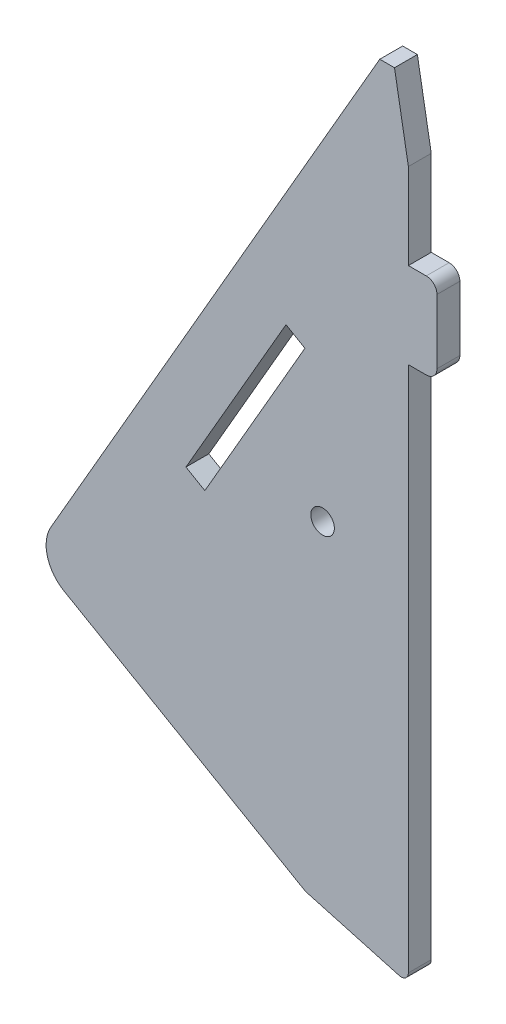
ISO-10303-21;
HEADER;
FILE_DESCRIPTION(('STEP AP214'),'2;1');
FILE_NAME('part.step','',(''),(''),'','','');
FILE_SCHEMA(('AUTOMOTIVE_DESIGN { 1 0 10303 214 1 1 1 1 }'));
ENDSEC;
DATA;
#1=APPLICATION_CONTEXT('core data for automotive mechanical design processes');
#2=APPLICATION_PROTOCOL_DEFINITION('international standard','automotive_design',2000,#1);
#3=PRODUCT_CONTEXT('',#1,'mechanical');
#4=PRODUCT('Part','Part','',(#3));
#5=PRODUCT_RELATED_PRODUCT_CATEGORY('part','',(#4));
#6=PRODUCT_DEFINITION_FORMATION('','',#4);
#7=PRODUCT_DEFINITION_CONTEXT('part definition',#1,'design');
#8=PRODUCT_DEFINITION('design','',#6,#7);
#9=PRODUCT_DEFINITION_SHAPE('','',#8);
#10=(LENGTH_UNIT() NAMED_UNIT(*) SI_UNIT(.MILLI.,.METRE.));
#11=(NAMED_UNIT(*) PLANE_ANGLE_UNIT() SI_UNIT($,.RADIAN.));
#12=(NAMED_UNIT(*) SI_UNIT($,.STERADIAN.) SOLID_ANGLE_UNIT());
#13=UNCERTAINTY_MEASURE_WITH_UNIT(LENGTH_MEASURE(1.E-05),#10,'distance_accuracy_value','');
#14=(GEOMETRIC_REPRESENTATION_CONTEXT(3) GLOBAL_UNCERTAINTY_ASSIGNED_CONTEXT((#13)) GLOBAL_UNIT_ASSIGNED_CONTEXT((#10,
#11,#12)) REPRESENTATION_CONTEXT('',''));
#15=CARTESIAN_POINT('',(0.,0.,0.));
#16=DIRECTION('',(0.,0.,1.));
#17=DIRECTION('',(1.,0.,0.));
#18=AXIS2_PLACEMENT_3D('',#15,#16,#17);
#19=CARTESIAN_POINT('',(49.9999999999627,44.0000000000083,3.2));
#20=DIRECTION('',(-1.,0.,0.));
#21=DIRECTION('',(0.,0.,1.));
#22=AXIS2_PLACEMENT_3D('',#19,#20,#21);
#23=PLANE('',#22);
#24=DIRECTION('',(0.,1.,0.));
#25=VECTOR('',#24,1.);
#26=CARTESIAN_POINT('',(49.9999999999627,44.0000000000083,3.2));
#27=LINE('',#26,#25);
#28=CARTESIAN_POINT('',(49.9999999999627,32.0000000000083,3.2));
#29=VERTEX_POINT('',#28);
#30=CARTESIAN_POINT('',(49.9999999999627,44.0000000000083,3.2));
#31=VERTEX_POINT('',#30);
#32=EDGE_CURVE('E210',#29,#31,#27,.T.);
#33=ORIENTED_EDGE('',*,*,#32,.F.);
#34=DIRECTION('',(0.,0.,1.));
#35=VECTOR('',#34,1.);
#36=CARTESIAN_POINT('',(49.9999999999627,32.0000000000083,-12.6491106406735));
#37=LINE('',#36,#35);
#38=CARTESIAN_POINT('',(49.9999999999627,32.0000000000083,0.));
#39=VERTEX_POINT('',#38);
#40=EDGE_CURVE('E209',#39,#29,#37,.T.);
#41=ORIENTED_EDGE('',*,*,#40,.F.);
#42=DIRECTION('',(0.,1.,0.));
#43=VECTOR('',#42,1.);
#44=CARTESIAN_POINT('',(49.9999999999627,44.0000000000083,0.));
#45=LINE('',#44,#43);
#46=CARTESIAN_POINT('',(49.9999999999627,44.0000000000083,0.));
#47=VERTEX_POINT('',#46);
#48=EDGE_CURVE('E192',#39,#47,#45,.T.);
#49=ORIENTED_EDGE('',*,*,#48,.T.);
#50=DIRECTION('',(0.,0.,-1.));
#51=VECTOR('',#50,1.);
#52=CARTESIAN_POINT('',(49.9999999999627,44.0000000000083,3.2));
#53=LINE('',#52,#51);
#54=EDGE_CURVE('E350',#31,#47,#53,.T.);
#55=ORIENTED_EDGE('',*,*,#54,.F.);
#56=EDGE_LOOP('',(#33,#41,#49,#55));
#57=FACE_BOUND('',#56,.T.);
#58=ADVANCED_FACE('F38',(#57),#23,.F.);
#59=CARTESIAN_POINT('',(48.9999999999626,-53.6846267095835,3.2));
#60=DIRECTION('',(0.,0.,1.));
#61=DIRECTION('',(1.,0.,0.));
#62=AXIS2_PLACEMENT_3D('',#59,#60,#61);
#63=PLANE('',#62);
#64=CARTESIAN_POINT('',(38.,-5.,3.2));
#65=DIRECTION('',(0.,0.,1.));
#66=DIRECTION('',(1.,0.,0.));
#67=AXIS2_PLACEMENT_3D('',#64,#65,#66);
#68=CIRCLE('',#67,1.65);
#69=CARTESIAN_POINT('',(39.65,-5.,3.2));
#70=VERTEX_POINT('',#69);
#71=EDGE_CURVE('E282',#70,#70,#68,.T.);
#72=ORIENTED_EDGE('',*,*,#71,.F.);
#73=EDGE_LOOP('',(#72));
#74=FACE_BOUND('',#73,.T.);
#75=DIRECTION('',(0.,1.,0.));
#76=VECTOR('',#75,1.);
#77=CARTESIAN_POINT('',(53.9999999999626,32.0000000000083,3.2));
#78=LINE('',#77,#76);
#79=CARTESIAN_POINT('',(53.9999999999626,21.5000000000083,3.2));
#80=VERTEX_POINT('',#79);
#81=CARTESIAN_POINT('',(53.9999999999626,30.5000000000083,3.2));
#82=VERTEX_POINT('',#81);
#83=EDGE_CURVE('E230',#80,#82,#78,.T.);
#84=ORIENTED_EDGE('',*,*,#83,.T.);
#85=CARTESIAN_POINT('',(52.4999999999626,30.5000000000083,3.2));
#86=DIRECTION('',(0.,0.,1.));
#87=DIRECTION('',(1.,0.,0.));
#88=AXIS2_PLACEMENT_3D('',#85,#86,#87);
#89=CIRCLE('',#88,1.5);
#90=CARTESIAN_POINT('',(52.4999999999626,32.0000000000083,3.2));
#91=VERTEX_POINT('',#90);
#92=EDGE_CURVE('E369',#82,#91,#89,.T.);
#93=ORIENTED_EDGE('',*,*,#92,.T.);
#94=DIRECTION('',(-1.,0.,0.));
#95=VECTOR('',#94,1.);
#96=CARTESIAN_POINT('',(49.9999999999627,32.0000000000083,3.2));
#97=LINE('',#96,#95);
#98=EDGE_CURVE('E234',#91,#29,#97,.T.);
#99=ORIENTED_EDGE('',*,*,#98,.T.);
#100=ORIENTED_EDGE('',*,*,#32,.T.);
#101=DIRECTION('',(-0.173648177667528,0.984807753012103,0.));
#102=VECTOR('',#101,1.);
#103=CARTESIAN_POINT('',(49.9999999999627,44.0000000000083,3.2));
#104=LINE('',#103,#102);
#105=CARTESIAN_POINT('',(48.0604032121626,55.0000000000083,3.2));
#106=VERTEX_POINT('',#105);
#107=EDGE_CURVE('E301',#31,#106,#104,.T.);
#108=ORIENTED_EDGE('',*,*,#107,.T.);
#109=DIRECTION('',(-1.,0.,0.));
#110=VECTOR('',#109,1.);
#111=CARTESIAN_POINT('',(45.9999999999626,55.0000000000083,3.2));
#112=LINE('',#111,#110);
#113=CARTESIAN_POINT('',(45.9999999999626,55.0000000000083,3.2));
#114=VERTEX_POINT('',#113);
#115=EDGE_CURVE('E303',#106,#114,#112,.T.);
#116=ORIENTED_EDGE('',*,*,#115,.T.);
#117=DIRECTION('',(-0.5,-0.866025403784439,0.));
#118=VECTOR('',#117,1.);
#119=CARTESIAN_POINT('',(-4.52970386238235E-11,-24.6743371481738,3.2));
#120=LINE('',#119,#118);
#121=CARTESIAN_POINT('',(-4.52953646812304E-11,-24.6743371481738,3.2));
#122=VERTEX_POINT('',#121);
#123=EDGE_CURVE('E305',#114,#122,#120,.T.);
#124=ORIENTED_EDGE('',*,*,#123,.T.);
#125=CARTESIAN_POINT('',(4.33012701887688,-27.1743371481738,3.2));
#126=DIRECTION('',(0.,0.,1.));
#127=DIRECTION('',(1.,0.,0.));
#128=AXIS2_PLACEMENT_3D('',#125,#126,#127);
#129=CIRCLE('',#128,4.99999999999998);
#130=CARTESIAN_POINT('',(1.83012701886026,-31.5044641670864,3.2));
#131=VERTEX_POINT('',#130);
#132=EDGE_CURVE('E308',#122,#131,#129,.T.);
#133=ORIENTED_EDGE('',*,*,#132,.T.);
#134=DIRECTION('',(0.866025403784439,-0.5,0.));
#135=VECTOR('',#134,1.);
#136=CARTESIAN_POINT('',(1.83012701886026,-31.5044641670864,3.2));
#137=LINE('',#136,#135);
#138=CARTESIAN_POINT('',(35.6051177664489,-51.0044641670838,3.2));
#139=VERTEX_POINT('',#138);
#140=EDGE_CURVE('E311',#131,#139,#137,.T.);
#141=ORIENTED_EDGE('',*,*,#140,.T.);
#142=DIRECTION('',(0.963570411999862,-0.267454783315641,0.));
#143=VECTOR('',#142,1.);
#144=CARTESIAN_POINT('',(35.6051177664489,-51.0044641670838,3.2));
#145=LINE('',#144,#143);
#146=CARTESIAN_POINT('',(48.7325452166489,-54.6481971215838,3.2));
#147=VERTEX_POINT('',#146);
#148=EDGE_CURVE('E290',#139,#147,#145,.T.);
#149=ORIENTED_EDGE('',*,*,#148,.T.);
#150=CARTESIAN_POINT('',(48.9999999999626,-53.6846267095835,3.2));
#151=DIRECTION('',(0.,0.,1.));
#152=DIRECTION('',(1.,0.,0.));
#153=AXIS2_PLACEMENT_3D('',#150,#151,#152);
#154=CIRCLE('',#153,0.999999999999998);
#155=CARTESIAN_POINT('',(49.9999999999627,-53.6846267095839,3.2));
#156=VERTEX_POINT('',#155);
#157=EDGE_CURVE('E294',#147,#156,#154,.T.);
#158=ORIENTED_EDGE('',*,*,#157,.T.);
#159=CARTESIAN_POINT('',(49.9999999999627,20.0000000000083,3.2));
#160=VERTEX_POINT('',#159);
#161=EDGE_CURVE('E297',#156,#160,#27,.T.);
#162=ORIENTED_EDGE('',*,*,#161,.T.);
#163=DIRECTION('',(1.,0.,0.));
#164=VECTOR('',#163,1.);
#165=CARTESIAN_POINT('',(49.9999999999627,20.0000000000083,3.2));
#166=LINE('',#165,#164);
#167=CARTESIAN_POINT('',(52.4999999999626,20.0000000000083,3.2));
#168=VERTEX_POINT('',#167);
#169=EDGE_CURVE('E226',#160,#168,#166,.T.);
#170=ORIENTED_EDGE('',*,*,#169,.T.);
#171=CARTESIAN_POINT('',(52.4999999999626,21.5000000000083,3.2));
#172=DIRECTION('',(0.,0.,1.));
#173=DIRECTION('',(1.,0.,0.));
#174=AXIS2_PLACEMENT_3D('',#171,#172,#173);
#175=CIRCLE('',#174,1.5);
#176=EDGE_CURVE('E366',#168,#80,#175,.T.);
#177=ORIENTED_EDGE('',*,*,#176,.T.);
#178=EDGE_LOOP('',(#84,#93,#99,#100,#108,#116,#124,#133,#141,#149,#158,#162,#170,#177));
#179=FACE_BOUND('',#178,.T.);
#180=DIRECTION('',(0.5,0.866025403784439,0.));
#181=VECTOR('',#180,1.);
#182=CARTESIAN_POINT('',(21.5341797856962,-9.49604366002328,3.2));
#183=LINE('',#182,#181);
#184=CARTESIAN_POINT('',(21.5341797856962,-9.49604366002328,3.2));
#185=VERTEX_POINT('',#184);
#186=CARTESIAN_POINT('',(35.5341797856684,14.7526676458928,3.2));
#187=VERTEX_POINT('',#186);
#188=EDGE_CURVE('E242',#185,#187,#183,.T.);
#189=ORIENTED_EDGE('',*,*,#188,.F.);
#190=DIRECTION('',(0.866025403784439,-0.5,0.));
#191=VECTOR('',#190,1.);
#192=CARTESIAN_POINT('',(18.8841420501011,-7.96604366001479,3.2));
#193=LINE('',#192,#191);
#194=CARTESIAN_POINT('',(18.8841420501011,-7.96604366001479,3.2));
#195=VERTEX_POINT('',#194);
#196=EDGE_CURVE('E239',#195,#185,#193,.T.);
#197=ORIENTED_EDGE('',*,*,#196,.F.);
#198=DIRECTION('',(-0.5,-0.866025403784438,0.));
#199=VECTOR('',#198,1.);
#200=CARTESIAN_POINT('',(18.8841420501011,-7.96604366001479,3.2));
#201=LINE('',#200,#199);
#202=CARTESIAN_POINT('',(32.8841420500733,16.2826676459013,3.2));
#203=VERTEX_POINT('',#202);
#204=EDGE_CURVE('E250',#203,#195,#201,.T.);
#205=ORIENTED_EDGE('',*,*,#204,.F.);
#206=DIRECTION('',(-0.866025403784439,0.499999999999999,0.));
#207=VECTOR('',#206,1.);
#208=CARTESIAN_POINT('',(35.5341797856684,14.7526676458928,3.2));
#209=LINE('',#208,#207);
#210=EDGE_CURVE('E246',#187,#203,#209,.T.);
#211=ORIENTED_EDGE('',*,*,#210,.F.);
#212=EDGE_LOOP('',(#189,#197,#205,#211));
#213=FACE_BOUND('',#212,.T.);
#214=ADVANCED_FACE('F385',(#74,#179,#213),#63,.T.);
#215=CARTESIAN_POINT('',(48.9999999999626,-53.6846267095835,0.));
#216=DIRECTION('',(0.,0.,1.));
#217=DIRECTION('',(1.,0.,0.));
#218=AXIS2_PLACEMENT_3D('',#215,#216,#217);
#219=PLANE('',#218);
#220=CARTESIAN_POINT('',(38.,-5.,0.));
#221=DIRECTION('',(0.,0.,1.));
#222=DIRECTION('',(1.,0.,0.));
#223=AXIS2_PLACEMENT_3D('',#220,#221,#222);
#224=CIRCLE('',#223,1.65);
#225=CARTESIAN_POINT('',(39.65,-5.,0.));
#226=VERTEX_POINT('',#225);
#227=EDGE_CURVE('E281',#226,#226,#224,.T.);
#228=ORIENTED_EDGE('',*,*,#227,.T.);
#229=EDGE_LOOP('',(#228));
#230=FACE_BOUND('',#229,.T.);
#231=DIRECTION('',(1.,0.,0.));
#232=VECTOR('',#231,1.);
#233=CARTESIAN_POINT('',(49.9999999999627,32.0000000000083,0.));
#234=LINE('',#233,#232);
#235=CARTESIAN_POINT('',(52.4999999999626,32.0000000000083,0.));
#236=VERTEX_POINT('',#235);
#237=EDGE_CURVE('E196',#39,#236,#234,.T.);
#238=ORIENTED_EDGE('',*,*,#237,.T.);
#239=CARTESIAN_POINT('',(52.4999999999626,30.5000000000083,0.));
#240=DIRECTION('',(0.,0.,1.));
#241=DIRECTION('',(1.,0.,0.));
#242=AXIS2_PLACEMENT_3D('',#239,#240,#241);
#243=CIRCLE('',#242,1.5);
#244=CARTESIAN_POINT('',(53.9999999999626,30.5000000000083,0.));
#245=VERTEX_POINT('',#244);
#246=EDGE_CURVE('E47',#236,#245,#243,.F.);
#247=ORIENTED_EDGE('',*,*,#246,.T.);
#248=DIRECTION('',(0.,-1.,0.));
#249=VECTOR('',#248,1.);
#250=CARTESIAN_POINT('',(53.9999999999626,32.0000000000083,0.));
#251=LINE('',#250,#249);
#252=CARTESIAN_POINT('',(53.9999999999626,21.5000000000083,0.));
#253=VERTEX_POINT('',#252);
#254=EDGE_CURVE('E212',#245,#253,#251,.T.);
#255=ORIENTED_EDGE('',*,*,#254,.T.);
#256=CARTESIAN_POINT('',(52.4999999999626,21.5000000000083,0.));
#257=DIRECTION('',(0.,0.,1.));
#258=DIRECTION('',(1.,0.,0.));
#259=AXIS2_PLACEMENT_3D('',#256,#257,#258);
#260=CIRCLE('',#259,1.5);
#261=CARTESIAN_POINT('',(52.4999999999626,20.0000000000083,0.));
#262=VERTEX_POINT('',#261);
#263=EDGE_CURVE('E57',#253,#262,#260,.F.);
#264=ORIENTED_EDGE('',*,*,#263,.T.);
#265=DIRECTION('',(-1.,0.,0.));
#266=VECTOR('',#265,1.);
#267=CARTESIAN_POINT('',(49.9999999999627,20.0000000000083,0.));
#268=LINE('',#267,#266);
#269=CARTESIAN_POINT('',(49.9999999999627,20.0000000000083,0.));
#270=VERTEX_POINT('',#269);
#271=EDGE_CURVE('E217',#262,#270,#268,.T.);
#272=ORIENTED_EDGE('',*,*,#271,.T.);
#273=CARTESIAN_POINT('',(49.9999999999627,-53.6846267095839,0.));
#274=VERTEX_POINT('',#273);
#275=EDGE_CURVE('E204',#274,#270,#45,.T.);
#276=ORIENTED_EDGE('',*,*,#275,.F.);
#277=CARTESIAN_POINT('',(48.9999999999626,-53.6846267095835,0.));
#278=DIRECTION('',(0.,0.,1.));
#279=DIRECTION('',(1.,0.,0.));
#280=AXIS2_PLACEMENT_3D('',#277,#278,#279);
#281=CIRCLE('',#280,0.999999999999998);
#282=CARTESIAN_POINT('',(48.7325452166489,-54.6481971215838,0.));
#283=VERTEX_POINT('',#282);
#284=EDGE_CURVE('E205',#283,#274,#281,.T.);
#285=ORIENTED_EDGE('',*,*,#284,.F.);
#286=DIRECTION('',(0.963570411999862,-0.267454783315641,0.));
#287=VECTOR('',#286,1.);
#288=CARTESIAN_POINT('',(35.6051177664489,-51.0044641670838,0.));
#289=LINE('',#288,#287);
#290=CARTESIAN_POINT('',(35.6051177664489,-51.0044641670838,0.));
#291=VERTEX_POINT('',#290);
#292=EDGE_CURVE('E286',#291,#283,#289,.T.);
#293=ORIENTED_EDGE('',*,*,#292,.F.);
#294=DIRECTION('',(0.866025403784439,-0.5,0.));
#295=VECTOR('',#294,1.);
#296=CARTESIAN_POINT('',(1.83012701886026,-31.5044641670864,0.));
#297=LINE('',#296,#295);
#298=CARTESIAN_POINT('',(1.83012701886026,-31.5044641670864,0.));
#299=VERTEX_POINT('',#298);
#300=EDGE_CURVE('E295',#299,#291,#297,.T.);
#301=ORIENTED_EDGE('',*,*,#300,.F.);
#302=CARTESIAN_POINT('',(4.33012701887688,-27.1743371481738,0.));
#303=DIRECTION('',(0.,0.,1.));
#304=DIRECTION('',(1.,0.,0.));
#305=AXIS2_PLACEMENT_3D('',#302,#303,#304);
#306=CIRCLE('',#305,4.99999999999998);
#307=CARTESIAN_POINT('',(-4.52953646812304E-11,-24.6743371481738,0.));
#308=VERTEX_POINT('',#307);
#309=EDGE_CURVE('E328',#308,#299,#306,.T.);
#310=ORIENTED_EDGE('',*,*,#309,.F.);
#311=DIRECTION('',(-0.5,-0.866025403784439,0.));
#312=VECTOR('',#311,1.);
#313=CARTESIAN_POINT('',(-4.52970386238235E-11,-24.6743371481738,0.));
#314=LINE('',#313,#312);
#315=CARTESIAN_POINT('',(45.9999999999626,55.0000000000083,0.));
#316=VERTEX_POINT('',#315);
#317=EDGE_CURVE('E325',#316,#308,#314,.T.);
#318=ORIENTED_EDGE('',*,*,#317,.F.);
#319=DIRECTION('',(-1.,0.,0.));
#320=VECTOR('',#319,1.);
#321=CARTESIAN_POINT('',(45.9999999999626,55.0000000000083,0.));
#322=LINE('',#321,#320);
#323=CARTESIAN_POINT('',(48.0604032121626,55.0000000000083,0.));
#324=VERTEX_POINT('',#323);
#325=EDGE_CURVE('E323',#324,#316,#322,.T.);
#326=ORIENTED_EDGE('',*,*,#325,.F.);
#327=DIRECTION('',(-0.173648177667528,0.984807753012103,0.));
#328=VECTOR('',#327,1.);
#329=CARTESIAN_POINT('',(49.9999999999627,44.0000000000083,0.));
#330=LINE('',#329,#328);
#331=EDGE_CURVE('E199',#47,#324,#330,.T.);
#332=ORIENTED_EDGE('',*,*,#331,.F.);
#333=ORIENTED_EDGE('',*,*,#48,.F.);
#334=EDGE_LOOP('',(#238,#247,#255,#264,#272,#276,#285,#293,#301,#310,#318,#326,#332,#333));
#335=FACE_BOUND('',#334,.T.);
#336=DIRECTION('',(0.866025403784439,-0.5,0.));
#337=VECTOR('',#336,1.);
#338=CARTESIAN_POINT('',(18.8841420501011,-7.96604366001479,0.));
#339=LINE('',#338,#337);
#340=CARTESIAN_POINT('',(18.8841420501011,-7.96604366001479,0.));
#341=VERTEX_POINT('',#340);
#342=CARTESIAN_POINT('',(21.5341797856962,-9.49604366002328,0.));
#343=VERTEX_POINT('',#342);
#344=EDGE_CURVE('E221',#341,#343,#339,.T.);
#345=ORIENTED_EDGE('',*,*,#344,.T.);
#346=DIRECTION('',(0.5,0.866025403784439,0.));
#347=VECTOR('',#346,1.);
#348=CARTESIAN_POINT('',(21.5341797856962,-9.49604366002328,0.));
#349=LINE('',#348,#347);
#350=CARTESIAN_POINT('',(35.5341797856684,14.7526676458928,0.));
#351=VERTEX_POINT('',#350);
#352=EDGE_CURVE('E257',#343,#351,#349,.T.);
#353=ORIENTED_EDGE('',*,*,#352,.T.);
#354=DIRECTION('',(-0.866025403784439,0.499999999999999,0.));
#355=VECTOR('',#354,1.);
#356=CARTESIAN_POINT('',(35.5341797856684,14.7526676458928,0.));
#357=LINE('',#356,#355);
#358=CARTESIAN_POINT('',(32.8841420500733,16.2826676459013,0.));
#359=VERTEX_POINT('',#358);
#360=EDGE_CURVE('E261',#351,#359,#357,.T.);
#361=ORIENTED_EDGE('',*,*,#360,.T.);
#362=DIRECTION('',(-0.5,-0.866025403784438,0.));
#363=VECTOR('',#362,1.);
#364=CARTESIAN_POINT('',(18.8841420501011,-7.96604366001479,0.));
#365=LINE('',#364,#363);
#366=EDGE_CURVE('E243',#359,#341,#365,.T.);
#367=ORIENTED_EDGE('',*,*,#366,.T.);
#368=EDGE_LOOP('',(#345,#353,#361,#367));
#369=FACE_BOUND('',#368,.T.);
#370=ADVANCED_FACE('F194',(#230,#335,#369),#219,.F.);
#371=CARTESIAN_POINT('',(35.6051177664489,-51.0044641670838,3.2));
#372=DIRECTION('',(0.267454783315641,0.963570411999862,0.));
#373=DIRECTION('',(-0.963570411999862,0.267454783315641,0.));
#374=AXIS2_PLACEMENT_3D('',#371,#372,#373);
#375=PLANE('',#374);
#376=ORIENTED_EDGE('',*,*,#292,.T.);
#377=DIRECTION('',(0.,0.,-1.));
#378=VECTOR('',#377,1.);
#379=CARTESIAN_POINT('',(48.7325452166489,-54.6481971215838,3.2));
#380=LINE('',#379,#378);
#381=EDGE_CURVE('E356',#147,#283,#380,.T.);
#382=ORIENTED_EDGE('',*,*,#381,.F.);
#383=ORIENTED_EDGE('',*,*,#148,.F.);
#384=DIRECTION('',(0.,0.,-1.));
#385=VECTOR('',#384,1.);
#386=CARTESIAN_POINT('',(35.6051177664489,-51.0044641670838,3.2));
#387=LINE('',#386,#385);
#388=EDGE_CURVE('E314',#139,#291,#387,.T.);
#389=ORIENTED_EDGE('',*,*,#388,.T.);
#390=EDGE_LOOP('',(#376,#382,#383,#389));
#391=FACE_BOUND('',#390,.T.);
#392=ADVANCED_FACE('F405',(#391),#375,.F.);
#393=CARTESIAN_POINT('',(48.9999999999626,-53.6846267095835,3.2));
#394=DIRECTION('',(0.,0.,-1.));
#395=DIRECTION('',(-1.,0.,0.));
#396=AXIS2_PLACEMENT_3D('',#393,#394,#395);
#397=CYLINDRICAL_SURFACE('',#396,0.999999999999998);
#398=ORIENTED_EDGE('',*,*,#284,.T.);
#399=DIRECTION('',(0.,0.,-1.));
#400=VECTOR('',#399,1.);
#401=CARTESIAN_POINT('',(49.9999999999627,-53.6846267095839,3.2));
#402=LINE('',#401,#400);
#403=EDGE_CURVE('E353',#156,#274,#402,.T.);
#404=ORIENTED_EDGE('',*,*,#403,.F.);
#405=ORIENTED_EDGE('',*,*,#157,.F.);
#406=ORIENTED_EDGE('',*,*,#381,.T.);
#407=EDGE_LOOP('',(#398,#404,#405,#406));
#408=FACE_BOUND('',#407,.T.);
#409=ADVANCED_FACE('F402',(#408),#397,.T.);
#410=ORIENTED_EDGE('',*,*,#275,.T.);
#411=DIRECTION('',(0.,0.,1.));
#412=VECTOR('',#411,1.);
#413=CARTESIAN_POINT('',(49.9999999999627,20.0000000000083,-12.6491106406735));
#414=LINE('',#413,#412);
#415=EDGE_CURVE('E213',#270,#160,#414,.T.);
#416=ORIENTED_EDGE('',*,*,#415,.T.);
#417=ORIENTED_EDGE('',*,*,#161,.F.);
#418=ORIENTED_EDGE('',*,*,#403,.T.);
#419=EDGE_LOOP('',(#410,#416,#417,#418));
#420=FACE_BOUND('',#419,.T.);
#421=ADVANCED_FACE('F396',(#420),#23,.F.);
#422=CARTESIAN_POINT('',(49.9999999999627,44.0000000000083,3.2));
#423=DIRECTION('',(-0.984807753012103,-0.173648177667528,0.));
#424=DIRECTION('',(0.173648177667528,-0.984807753012103,0.));
#425=AXIS2_PLACEMENT_3D('',#422,#423,#424);
#426=PLANE('',#425);
#427=ORIENTED_EDGE('',*,*,#331,.T.);
#428=DIRECTION('',(0.,0.,-1.));
#429=VECTOR('',#428,1.);
#430=CARTESIAN_POINT('',(48.0604032121626,55.0000000000083,3.2));
#431=LINE('',#430,#429);
#432=EDGE_CURVE('E347',#106,#324,#431,.T.);
#433=ORIENTED_EDGE('',*,*,#432,.F.);
#434=ORIENTED_EDGE('',*,*,#107,.F.);
#435=ORIENTED_EDGE('',*,*,#54,.T.);
#436=EDGE_LOOP('',(#427,#433,#434,#435));
#437=FACE_BOUND('',#436,.T.);
#438=ADVANCED_FACE('F427',(#437),#426,.F.);
#439=CARTESIAN_POINT('',(45.9999999999626,55.0000000000083,3.2));
#440=DIRECTION('',(0.,-1.,0.));
#441=DIRECTION('',(0.,0.,-1.));
#442=AXIS2_PLACEMENT_3D('',#439,#440,#441);
#443=PLANE('',#442);
#444=ORIENTED_EDGE('',*,*,#325,.T.);
#445=DIRECTION('',(0.,0.,-1.));
#446=VECTOR('',#445,1.);
#447=CARTESIAN_POINT('',(45.9999999999626,55.0000000000083,3.2));
#448=LINE('',#447,#446);
#449=EDGE_CURVE('E344',#114,#316,#448,.T.);
#450=ORIENTED_EDGE('',*,*,#449,.F.);
#451=ORIENTED_EDGE('',*,*,#115,.F.);
#452=ORIENTED_EDGE('',*,*,#432,.T.);
#453=EDGE_LOOP('',(#444,#450,#451,#452));
#454=FACE_BOUND('',#453,.T.);
#455=ADVANCED_FACE('F423',(#454),#443,.F.);
#456=CARTESIAN_POINT('',(-4.52970386238235E-11,-24.6743371481738,3.2));
#457=DIRECTION('',(0.866025403784439,-0.5,0.));
#458=DIRECTION('',(0.5,0.866025403784439,0.));
#459=AXIS2_PLACEMENT_3D('',#456,#457,#458);
#460=PLANE('',#459);
#461=ORIENTED_EDGE('',*,*,#317,.T.);
#462=DIRECTION('',(0.,0.,-1.));
#463=VECTOR('',#462,1.);
#464=CARTESIAN_POINT('',(-4.52953646812304E-11,-24.6743371481738,3.2));
#465=LINE('',#464,#463);
#466=EDGE_CURVE('E340',#122,#308,#465,.T.);
#467=ORIENTED_EDGE('',*,*,#466,.F.);
#468=ORIENTED_EDGE('',*,*,#123,.F.);
#469=ORIENTED_EDGE('',*,*,#449,.T.);
#470=EDGE_LOOP('',(#461,#467,#468,#469));
#471=FACE_BOUND('',#470,.T.);
#472=ADVANCED_FACE('F419',(#471),#460,.F.);
#473=CARTESIAN_POINT('',(4.33012701887688,-27.1743371481738,3.2));
#474=DIRECTION('',(0.,0.,-1.));
#475=DIRECTION('',(-1.,0.,0.));
#476=AXIS2_PLACEMENT_3D('',#473,#474,#475);
#477=CYLINDRICAL_SURFACE('',#476,4.99999999999998);
#478=ORIENTED_EDGE('',*,*,#309,.T.);
#479=DIRECTION('',(0.,0.,-1.));
#480=VECTOR('',#479,1.);
#481=CARTESIAN_POINT('',(1.83012701886026,-31.5044641670864,3.2));
#482=LINE('',#481,#480);
#483=EDGE_CURVE('E336',#131,#299,#482,.T.);
#484=ORIENTED_EDGE('',*,*,#483,.F.);
#485=ORIENTED_EDGE('',*,*,#132,.F.);
#486=ORIENTED_EDGE('',*,*,#466,.T.);
#487=EDGE_LOOP('',(#478,#484,#485,#486));
#488=FACE_BOUND('',#487,.T.);
#489=ADVANCED_FACE('F414',(#488),#477,.T.);
#490=CARTESIAN_POINT('',(1.83012701886026,-31.5044641670864,3.2));
#491=DIRECTION('',(0.5,0.866025403784439,0.));
#492=DIRECTION('',(-0.866025403784439,0.5,0.));
#493=AXIS2_PLACEMENT_3D('',#490,#491,#492);
#494=PLANE('',#493);
#495=ORIENTED_EDGE('',*,*,#300,.T.);
#496=ORIENTED_EDGE('',*,*,#388,.F.);
#497=ORIENTED_EDGE('',*,*,#140,.F.);
#498=ORIENTED_EDGE('',*,*,#483,.T.);
#499=EDGE_LOOP('',(#495,#496,#497,#498));
#500=FACE_BOUND('',#499,.T.);
#501=ADVANCED_FACE('F409',(#500),#494,.F.);
#502=CARTESIAN_POINT('',(38.,-5.,3.2));
#503=DIRECTION('',(0.,0.,-1.));
#504=DIRECTION('',(-1.,0.,0.));
#505=AXIS2_PLACEMENT_3D('',#502,#503,#504);
#506=CYLINDRICAL_SURFACE('',#505,1.65);
#507=ORIENTED_EDGE('',*,*,#71,.T.);
#508=EDGE_LOOP('',(#507));
#509=FACE_BOUND('',#508,.T.);
#510=ORIENTED_EDGE('',*,*,#227,.F.);
#511=EDGE_LOOP('',(#510));
#512=FACE_BOUND('',#511,.T.);
#513=ADVANCED_FACE('F473',(#509,#512),#506,.F.);
#514=CARTESIAN_POINT('',(18.8841420501011,-7.96604366001479,3.2));
#515=DIRECTION('',(0.5,0.866025403784439,0.));
#516=DIRECTION('',(-0.866025403784439,0.5,0.));
#517=AXIS2_PLACEMENT_3D('',#514,#515,#516);
#518=PLANE('',#517);
#519=ORIENTED_EDGE('',*,*,#344,.F.);
#520=DIRECTION('',(0.,0.,-1.));
#521=VECTOR('',#520,1.);
#522=CARTESIAN_POINT('',(18.8841420501011,-7.96604366001479,3.2));
#523=LINE('',#522,#521);
#524=EDGE_CURVE('E253',#195,#341,#523,.T.);
#525=ORIENTED_EDGE('',*,*,#524,.F.);
#526=ORIENTED_EDGE('',*,*,#196,.T.);
#527=DIRECTION('',(0.,0.,-1.));
#528=VECTOR('',#527,1.);
#529=CARTESIAN_POINT('',(21.5341797856962,-9.49604366002328,3.2));
#530=LINE('',#529,#528);
#531=EDGE_CURVE('E277',#185,#343,#530,.T.);
#532=ORIENTED_EDGE('',*,*,#531,.T.);
#533=EDGE_LOOP('',(#519,#525,#526,#532));
#534=FACE_BOUND('',#533,.T.);
#535=ADVANCED_FACE('F469',(#534),#518,.T.);
#536=CARTESIAN_POINT('',(21.5341797856962,-9.49604366002328,3.2));
#537=DIRECTION('',(-0.866025403784439,0.5,0.));
#538=DIRECTION('',(-0.5,-0.866025403784439,0.));
#539=AXIS2_PLACEMENT_3D('',#536,#537,#538);
#540=PLANE('',#539);
#541=ORIENTED_EDGE('',*,*,#352,.F.);
#542=ORIENTED_EDGE('',*,*,#531,.F.);
#543=ORIENTED_EDGE('',*,*,#188,.T.);
#544=DIRECTION('',(0.,0.,-1.));
#545=VECTOR('',#544,1.);
#546=CARTESIAN_POINT('',(35.5341797856684,14.7526676458928,3.2));
#547=LINE('',#546,#545);
#548=EDGE_CURVE('E274',#187,#351,#547,.T.);
#549=ORIENTED_EDGE('',*,*,#548,.T.);
#550=EDGE_LOOP('',(#541,#542,#543,#549));
#551=FACE_BOUND('',#550,.T.);
#552=ADVANCED_FACE('F465',(#551),#540,.T.);
#553=CARTESIAN_POINT('',(35.5341797856684,14.7526676458928,3.2));
#554=DIRECTION('',(-0.499999999999999,-0.866025403784439,0.));
#555=DIRECTION('',(0.866025403784439,-0.499999999999999,0.));
#556=AXIS2_PLACEMENT_3D('',#553,#554,#555);
#557=PLANE('',#556);
#558=ORIENTED_EDGE('',*,*,#360,.F.);
#559=ORIENTED_EDGE('',*,*,#548,.F.);
#560=ORIENTED_EDGE('',*,*,#210,.T.);
#561=DIRECTION('',(0.,0.,-1.));
#562=VECTOR('',#561,1.);
#563=CARTESIAN_POINT('',(32.8841420500733,16.2826676459013,3.2));
#564=LINE('',#563,#562);
#565=EDGE_CURVE('E271',#203,#359,#564,.T.);
#566=ORIENTED_EDGE('',*,*,#565,.T.);
#567=EDGE_LOOP('',(#558,#559,#560,#566));
#568=FACE_BOUND('',#567,.T.);
#569=ADVANCED_FACE('F461',(#568),#557,.T.);
#570=CARTESIAN_POINT('',(18.8841420501011,-7.96604366001479,3.2));
#571=DIRECTION('',(0.866025403784438,-0.5,0.));
#572=DIRECTION('',(0.5,0.866025403784438,0.));
#573=AXIS2_PLACEMENT_3D('',#570,#571,#572);
#574=PLANE('',#573);
#575=ORIENTED_EDGE('',*,*,#366,.F.);
#576=ORIENTED_EDGE('',*,*,#565,.F.);
#577=ORIENTED_EDGE('',*,*,#204,.T.);
#578=ORIENTED_EDGE('',*,*,#524,.T.);
#579=EDGE_LOOP('',(#575,#576,#577,#578));
#580=FACE_BOUND('',#579,.T.);
#581=ADVANCED_FACE('F458',(#580),#574,.T.);
#582=CARTESIAN_POINT('',(49.9999999999627,32.0000000000083,-12.6491106406735));
#583=DIRECTION('',(0.,1.,0.));
#584=DIRECTION('',(0.,0.,1.));
#585=AXIS2_PLACEMENT_3D('',#582,#583,#584);
#586=PLANE('',#585);
#587=ORIENTED_EDGE('',*,*,#98,.F.);
#588=DIRECTION('',(0.,0.,1.));
#589=VECTOR('',#588,1.);
#590=CARTESIAN_POINT('',(52.4999999999626,32.0000000000083,-12.6491106406735));
#591=LINE('',#590,#589);
#592=EDGE_CURVE('E68',#91,#236,#591,.F.);
#593=ORIENTED_EDGE('',*,*,#592,.T.);
#594=ORIENTED_EDGE('',*,*,#237,.F.);
#595=ORIENTED_EDGE('',*,*,#40,.T.);
#596=EDGE_LOOP('',(#587,#593,#594,#595));
#597=FACE_BOUND('',#596,.T.);
#598=ADVANCED_FACE('F215',(#597),#586,.T.);
#599=CARTESIAN_POINT('',(53.9999999999626,32.0000000000083,-12.6491106406735));
#600=DIRECTION('',(1.,0.,0.));
#601=DIRECTION('',(0.,1.,0.));
#602=AXIS2_PLACEMENT_3D('',#599,#600,#601);
#603=PLANE('',#602);
#604=ORIENTED_EDGE('',*,*,#254,.F.);
#605=DIRECTION('',(0.,0.,1.));
#606=VECTOR('',#605,1.);
#607=CARTESIAN_POINT('',(53.9999999999626,30.5000000000083,-12.6491106406735));
#608=LINE('',#607,#606);
#609=EDGE_CURVE('E362',#245,#82,#608,.T.);
#610=ORIENTED_EDGE('',*,*,#609,.T.);
#611=ORIENTED_EDGE('',*,*,#83,.F.);
#612=DIRECTION('',(0.,0.,1.));
#613=VECTOR('',#612,1.);
#614=CARTESIAN_POINT('',(53.9999999999626,21.5000000000083,-12.6491106406735));
#615=LINE('',#614,#613);
#616=EDGE_CURVE('E359',#80,#253,#615,.F.);
#617=ORIENTED_EDGE('',*,*,#616,.T.);
#618=EDGE_LOOP('',(#604,#610,#611,#617));
#619=FACE_BOUND('',#618,.T.);
#620=ADVANCED_FACE('F380',(#619),#603,.T.);
#621=CARTESIAN_POINT('',(49.9999999999627,20.0000000000083,-12.6491106406735));
#622=DIRECTION('',(0.,-1.,0.));
#623=DIRECTION('',(0.,0.,-1.));
#624=AXIS2_PLACEMENT_3D('',#621,#622,#623);
#625=PLANE('',#624);
#626=ORIENTED_EDGE('',*,*,#271,.F.);
#627=DIRECTION('',(0.,0.,1.));
#628=VECTOR('',#627,1.);
#629=CARTESIAN_POINT('',(52.4999999999626,20.0000000000083,-12.6491106406735));
#630=LINE('',#629,#628);
#631=EDGE_CURVE('E11',#262,#168,#630,.T.);
#632=ORIENTED_EDGE('',*,*,#631,.T.);
#633=ORIENTED_EDGE('',*,*,#169,.F.);
#634=ORIENTED_EDGE('',*,*,#415,.F.);
#635=EDGE_LOOP('',(#626,#632,#633,#634));
#636=FACE_BOUND('',#635,.T.);
#637=ADVANCED_FACE('F391',(#636),#625,.T.);
#638=CARTESIAN_POINT('',(52.4999999999626,30.5000000000083,-12.6491106406735));
#639=DIRECTION('',(0.,0.,1.));
#640=DIRECTION('',(1.,0.,0.));
#641=AXIS2_PLACEMENT_3D('',#638,#639,#640);
#642=CYLINDRICAL_SURFACE('',#641,1.5);
#643=ORIENTED_EDGE('',*,*,#246,.F.);
#644=ORIENTED_EDGE('',*,*,#592,.F.);
#645=ORIENTED_EDGE('',*,*,#92,.F.);
#646=ORIENTED_EDGE('',*,*,#609,.F.);
#647=EDGE_LOOP('',(#643,#644,#645,#646));
#648=FACE_BOUND('',#647,.T.);
#649=ADVANCED_FACE('F383',(#648),#642,.T.);
#650=CARTESIAN_POINT('',(52.4999999999626,21.5000000000083,-12.6491106406735));
#651=DIRECTION('',(0.,0.,1.));
#652=DIRECTION('',(1.,0.,0.));
#653=AXIS2_PLACEMENT_3D('',#650,#651,#652);
#654=CYLINDRICAL_SURFACE('',#653,1.5);
#655=ORIENTED_EDGE('',*,*,#263,.F.);
#656=ORIENTED_EDGE('',*,*,#616,.F.);
#657=ORIENTED_EDGE('',*,*,#176,.F.);
#658=ORIENTED_EDGE('',*,*,#631,.F.);
#659=EDGE_LOOP('',(#655,#656,#657,#658));
#660=FACE_BOUND('',#659,.T.);
#661=ADVANCED_FACE('F40',(#660),#654,.T.);
#662=CLOSED_SHELL('',(#58,#214,#370,#392,#409,#421,#438,#455,#472,#489,#501,#513,#535,#552,#569,
#581,#598,#620,#637,#649,#661));
#663=MANIFOLD_SOLID_BREP('B2',#662);
#664=ADVANCED_BREP_SHAPE_REPRESENTATION('',(#18,#663),#14);
#665=SHAPE_DEFINITION_REPRESENTATION(#9,#664);
ENDSEC;
END-ISO-10303-21;
